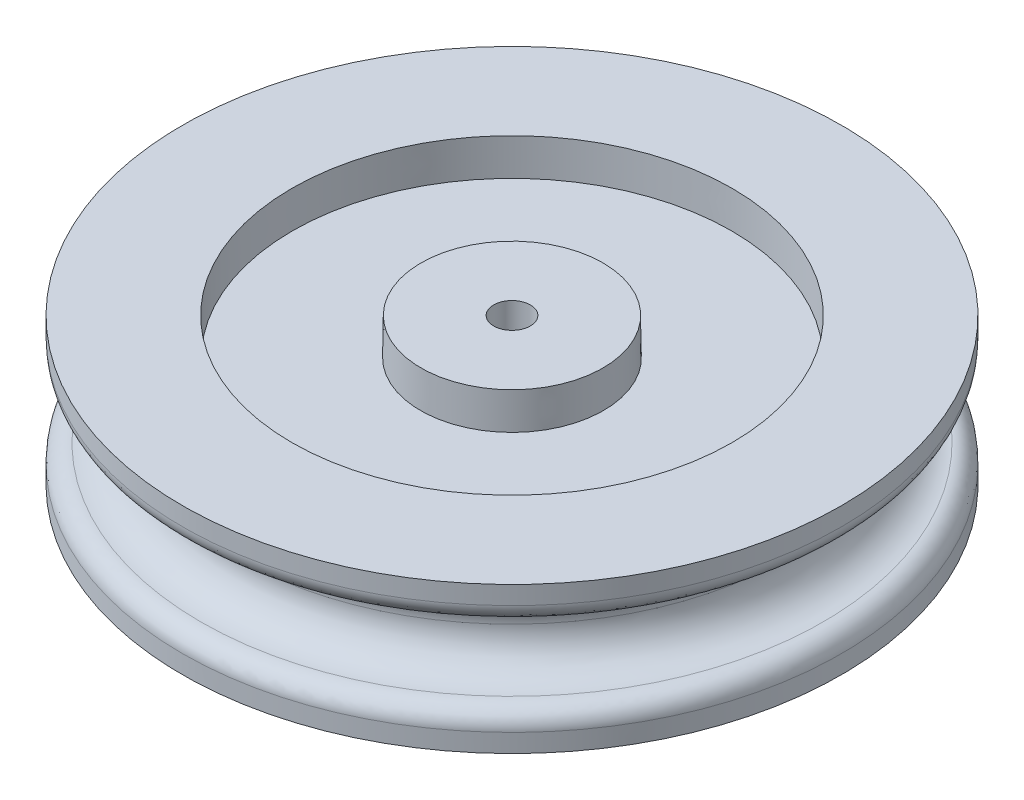
ISO-10303-21;
HEADER;
FILE_DESCRIPTION(('STEP AP214'),'2;1');
FILE_NAME('part.step','',(''),(''),'','','');
FILE_SCHEMA(('AUTOMOTIVE_DESIGN { 1 0 10303 214 1 1 1 1 }'));
ENDSEC;
DATA;
#1=APPLICATION_CONTEXT('core data for automotive mechanical design processes');
#2=APPLICATION_PROTOCOL_DEFINITION('international standard','automotive_design',2000,#1);
#3=PRODUCT_CONTEXT('',#1,'mechanical');
#4=PRODUCT('Part','Part','',(#3));
#5=PRODUCT_RELATED_PRODUCT_CATEGORY('part','',(#4));
#6=PRODUCT_DEFINITION_FORMATION('','',#4);
#7=PRODUCT_DEFINITION_CONTEXT('part definition',#1,'design');
#8=PRODUCT_DEFINITION('design','',#6,#7);
#9=PRODUCT_DEFINITION_SHAPE('','',#8);
#10=(LENGTH_UNIT() NAMED_UNIT(*) SI_UNIT(.MILLI.,.METRE.));
#11=(NAMED_UNIT(*) PLANE_ANGLE_UNIT() SI_UNIT($,.RADIAN.));
#12=(NAMED_UNIT(*) SI_UNIT($,.STERADIAN.) SOLID_ANGLE_UNIT());
#13=UNCERTAINTY_MEASURE_WITH_UNIT(LENGTH_MEASURE(1.E-05),#10,'distance_accuracy_value','');
#14=(GEOMETRIC_REPRESENTATION_CONTEXT(3) GLOBAL_UNCERTAINTY_ASSIGNED_CONTEXT((#13)) GLOBAL_UNIT_ASSIGNED_CONTEXT((#10,
#11,#12)) REPRESENTATION_CONTEXT('',''));
#15=CARTESIAN_POINT('',(0.,0.,0.));
#16=DIRECTION('',(0.,0.,1.));
#17=DIRECTION('',(1.,0.,0.));
#18=AXIS2_PLACEMENT_3D('',#15,#16,#17);
#19=CARTESIAN_POINT('',(0.,-1.2,0.));
#20=DIRECTION('',(0.,-1.,0.));
#21=DIRECTION('',(0.,0.,-1.));
#22=AXIS2_PLACEMENT_3D('',#19,#20,#21);
#23=CONICAL_SURFACE('',#22,1.,0.785398163397448);
#24=CARTESIAN_POINT('',(0.,-1.2,0.));
#25=DIRECTION('',(0.,-1.,0.));
#26=DIRECTION('',(0.,0.,-1.));
#27=AXIS2_PLACEMENT_3D('',#24,#25,#26);
#28=CIRCLE('',#27,1.);
#29=CARTESIAN_POINT('',(0.,-1.2,-1.));
#30=VERTEX_POINT('',#29);
#31=EDGE_CURVE('E41',#30,#30,#28,.T.);
#32=ORIENTED_EDGE('',*,*,#31,.F.);
#33=EDGE_LOOP('',(#32));
#34=FACE_BOUND('',#33,.T.);
#35=CARTESIAN_POINT('',(0.,-1.49999999999995,0.));
#36=DIRECTION('',(0.,-1.,0.));
#37=DIRECTION('',(0.,0.,-1.));
#38=AXIS2_PLACEMENT_3D('',#35,#36,#37);
#39=CIRCLE('',#38,1.29999999999995);
#40=CARTESIAN_POINT('',(0.,-1.49999999999995,-1.29999999999995));
#41=VERTEX_POINT('',#40);
#42=EDGE_CURVE('E17',#41,#41,#39,.F.);
#43=ORIENTED_EDGE('',*,*,#42,.F.);
#44=EDGE_LOOP('',(#43));
#45=FACE_BOUND('',#44,.T.);
#46=ADVANCED_FACE('F14',(#34,#45),#23,.F.);
#47=CARTESIAN_POINT('',(0.,2.7,0.));
#48=DIRECTION('',(0.,-1.,0.));
#49=DIRECTION('',(0.,0.,-1.));
#50=AXIS2_PLACEMENT_3D('',#47,#48,#49);
#51=CYLINDRICAL_SURFACE('',#50,1.);
#52=CARTESIAN_POINT('',(0.,2.7,0.));
#53=DIRECTION('',(0.,-1.,0.));
#54=DIRECTION('',(0.,0.,-1.));
#55=AXIS2_PLACEMENT_3D('',#52,#53,#54);
#56=CIRCLE('',#55,1.);
#57=CARTESIAN_POINT('',(0.,2.7,-1.));
#58=VERTEX_POINT('',#57);
#59=EDGE_CURVE('E76',#58,#58,#56,.T.);
#60=ORIENTED_EDGE('',*,*,#59,.F.);
#61=EDGE_LOOP('',(#60));
#62=FACE_BOUND('',#61,.T.);
#63=ORIENTED_EDGE('',*,*,#31,.T.);
#64=EDGE_LOOP('',(#63));
#65=FACE_BOUND('',#64,.T.);
#66=ADVANCED_FACE('F87',(#62,#65),#51,.F.);
#67=CARTESIAN_POINT('',(0.,-1.5,0.));
#68=DIRECTION('',(0.,-1.,0.));
#69=DIRECTION('',(0.,0.,-1.));
#70=AXIS2_PLACEMENT_3D('',#67,#68,#69);
#71=PLANE('',#70);
#72=ORIENTED_EDGE('',*,*,#42,.T.);
#73=EDGE_LOOP('',(#72));
#74=FACE_BOUND('',#73,.T.);
#75=CARTESIAN_POINT('',(0.,-1.49999999999995,0.));
#76=DIRECTION('',(0.,1.,0.));
#77=DIRECTION('',(0.,0.,1.));
#78=AXIS2_PLACEMENT_3D('',#75,#76,#77);
#79=CIRCLE('',#78,2.465091146);
#80=CARTESIAN_POINT('',(0.,-1.49999999999995,2.465091146));
#81=VERTEX_POINT('',#80);
#82=EDGE_CURVE('E74',#81,#81,#79,.T.);
#83=ORIENTED_EDGE('',*,*,#82,.F.);
#84=EDGE_LOOP('',(#83));
#85=FACE_BOUND('',#84,.T.);
#86=ADVANCED_FACE('F83',(#74,#85),#71,.T.);
#87=CARTESIAN_POINT('',(0.,2.7,0.));
#88=DIRECTION('',(0.,1.,0.));
#89=DIRECTION('',(0.,0.,1.));
#90=AXIS2_PLACEMENT_3D('',#87,#88,#89);
#91=PLANE('',#90);
#92=CARTESIAN_POINT('',(0.,2.7,0.));
#93=DIRECTION('',(0.,1.,0.));
#94=DIRECTION('',(0.,0.,1.));
#95=AXIS2_PLACEMENT_3D('',#92,#93,#94);
#96=CIRCLE('',#95,0.5);
#97=CARTESIAN_POINT('',(0.,2.7,0.5));
#98=VERTEX_POINT('',#97);
#99=EDGE_CURVE('E71',#98,#98,#96,.F.);
#100=ORIENTED_EDGE('',*,*,#99,.F.);
#101=EDGE_LOOP('',(#100));
#102=FACE_BOUND('',#101,.T.);
#103=ORIENTED_EDGE('',*,*,#59,.T.);
#104=EDGE_LOOP('',(#103));
#105=FACE_BOUND('',#104,.T.);
#106=ADVANCED_FACE('F183',(#102,#105),#91,.F.);
#107=CARTESIAN_POINT('',(0.,1.,0.));
#108=DIRECTION('',(0.,1.,0.));
#109=DIRECTION('',(0.,0.,1.));
#110=AXIS2_PLACEMENT_3D('',#107,#108,#109);
#111=CONICAL_SURFACE('',#110,2.5,0.0139626341667435);
#112=CARTESIAN_POINT('',(0.,1.,0.));
#113=DIRECTION('',(0.,1.,0.));
#114=DIRECTION('',(0.,0.,1.));
#115=AXIS2_PLACEMENT_3D('',#112,#113,#114);
#116=CIRCLE('',#115,2.5);
#117=CARTESIAN_POINT('',(0.,1.,2.5));
#118=VERTEX_POINT('',#117);
#119=EDGE_CURVE('E68',#118,#118,#116,.T.);
#120=ORIENTED_EDGE('',*,*,#119,.F.);
#121=EDGE_LOOP('',(#120));
#122=FACE_BOUND('',#121,.T.);
#123=ORIENTED_EDGE('',*,*,#82,.T.);
#124=EDGE_LOOP('',(#123));
#125=FACE_BOUND('',#124,.T.);
#126=ADVANCED_FACE('F179',(#122,#125),#111,.T.);
#127=CARTESIAN_POINT('',(0.,2.7,0.));
#128=DIRECTION('',(0.,1.,0.));
#129=DIRECTION('',(0.,0.,1.));
#130=AXIS2_PLACEMENT_3D('',#127,#128,#129);
#131=CYLINDRICAL_SURFACE('',#130,0.5);
#132=CARTESIAN_POINT('',(0.,4.,0.));
#133=DIRECTION('',(0.,1.,0.));
#134=DIRECTION('',(0.,0.,1.));
#135=AXIS2_PLACEMENT_3D('',#132,#133,#134);
#136=CIRCLE('',#135,0.5);
#137=CARTESIAN_POINT('',(0.,4.,0.5));
#138=VERTEX_POINT('',#137);
#139=EDGE_CURVE('E65',#138,#138,#136,.F.);
#140=ORIENTED_EDGE('',*,*,#139,.F.);
#141=EDGE_LOOP('',(#140));
#142=FACE_BOUND('',#141,.T.);
#143=ORIENTED_EDGE('',*,*,#99,.T.);
#144=EDGE_LOOP('',(#143));
#145=FACE_BOUND('',#144,.T.);
#146=ADVANCED_FACE('F175',(#142,#145),#131,.F.);
#147=CARTESIAN_POINT('',(0.,1.,-2.5));
#148=DIRECTION('',(0.,-1.,0.));
#149=DIRECTION('',(0.,0.,-1.));
#150=AXIS2_PLACEMENT_3D('',#147,#148,#149);
#151=PLANE('',#150);
#152=ORIENTED_EDGE('',*,*,#119,.T.);
#153=EDGE_LOOP('',(#152));
#154=FACE_BOUND('',#153,.T.);
#155=CARTESIAN_POINT('',(0.,0.99999999999989,0.));
#156=DIRECTION('',(0.,-1.,0.));
#157=DIRECTION('',(0.,0.,-1.));
#158=AXIS2_PLACEMENT_3D('',#155,#156,#157);
#159=CIRCLE('',#158,6.);
#160=CARTESIAN_POINT('',(0.,0.99999999999989,-6.));
#161=VERTEX_POINT('',#160);
#162=EDGE_CURVE('E62',#161,#161,#159,.F.);
#163=ORIENTED_EDGE('',*,*,#162,.F.);
#164=EDGE_LOOP('',(#163));
#165=FACE_BOUND('',#164,.T.);
#166=ADVANCED_FACE('F171',(#154,#165),#151,.T.);
#167=CARTESIAN_POINT('',(0.,4.,-2.5));
#168=DIRECTION('',(0.,1.,0.));
#169=DIRECTION('',(0.,0.,1.));
#170=AXIS2_PLACEMENT_3D('',#167,#168,#169);
#171=PLANE('',#170);
#172=ORIENTED_EDGE('',*,*,#139,.T.);
#173=EDGE_LOOP('',(#172));
#174=FACE_BOUND('',#173,.T.);
#175=CARTESIAN_POINT('',(0.,4.,0.));
#176=DIRECTION('',(0.,-1.,0.));
#177=DIRECTION('',(0.,0.,-1.));
#178=AXIS2_PLACEMENT_3D('',#175,#176,#177);
#179=CIRCLE('',#178,2.486036459);
#180=CARTESIAN_POINT('',(0.,4.,-2.486036459));
#181=VERTEX_POINT('',#180);
#182=EDGE_CURVE('E59',#181,#181,#179,.T.);
#183=ORIENTED_EDGE('',*,*,#182,.F.);
#184=EDGE_LOOP('',(#183));
#185=FACE_BOUND('',#184,.T.);
#186=ADVANCED_FACE('F167',(#174,#185),#171,.T.);
#187=CARTESIAN_POINT('',(0.,1.,0.));
#188=DIRECTION('',(0.,-1.,0.));
#189=DIRECTION('',(0.,0.,-1.));
#190=AXIS2_PLACEMENT_3D('',#187,#188,#189);
#191=CONICAL_SURFACE('',#190,6.,0.0139626335668602);
#192=CARTESIAN_POINT('',(0.,0.,0.));
#193=DIRECTION('',(0.,-1.,0.));
#194=DIRECTION('',(0.,0.,-1.));
#195=AXIS2_PLACEMENT_3D('',#192,#193,#194);
#196=CIRCLE('',#195,6.013963541);
#197=CARTESIAN_POINT('',(0.,0.,-6.013963541));
#198=VERTEX_POINT('',#197);
#199=EDGE_CURVE('E56',#198,#198,#196,.F.);
#200=ORIENTED_EDGE('',*,*,#199,.F.);
#201=EDGE_LOOP('',(#200));
#202=FACE_BOUND('',#201,.T.);
#203=ORIENTED_EDGE('',*,*,#162,.T.);
#204=EDGE_LOOP('',(#203));
#205=FACE_BOUND('',#204,.T.);
#206=ADVANCED_FACE('F163',(#202,#205),#191,.F.);
#207=CARTESIAN_POINT('',(0.,3.,0.));
#208=DIRECTION('',(0.,-1.,0.));
#209=DIRECTION('',(0.,0.,-1.));
#210=AXIS2_PLACEMENT_3D('',#207,#208,#209);
#211=CONICAL_SURFACE('',#210,2.5,0.0139626335668606);
#212=ORIENTED_EDGE('',*,*,#182,.T.);
#213=EDGE_LOOP('',(#212));
#214=FACE_BOUND('',#213,.T.);
#215=CARTESIAN_POINT('',(0.,2.99999999999989,0.));
#216=DIRECTION('',(0.,-1.,0.));
#217=DIRECTION('',(0.,0.,-1.));
#218=AXIS2_PLACEMENT_3D('',#215,#216,#217);
#219=CIRCLE('',#218,2.5);
#220=CARTESIAN_POINT('',(0.,2.99999999999989,-2.5));
#221=VERTEX_POINT('',#220);
#222=EDGE_CURVE('E53',#221,#221,#219,.T.);
#223=ORIENTED_EDGE('',*,*,#222,.F.);
#224=EDGE_LOOP('',(#223));
#225=FACE_BOUND('',#224,.T.);
#226=ADVANCED_FACE('F159',(#214,#225),#211,.T.);
#227=CARTESIAN_POINT('',(0.,0.,-6.));
#228=DIRECTION('',(0.,-1.,0.));
#229=DIRECTION('',(0.,0.,-1.));
#230=AXIS2_PLACEMENT_3D('',#227,#228,#229);
#231=PLANE('',#230);
#232=ORIENTED_EDGE('',*,*,#199,.T.);
#233=EDGE_LOOP('',(#232));
#234=FACE_BOUND('',#233,.T.);
#235=CARTESIAN_POINT('',(0.,0.,0.));
#236=DIRECTION('',(0.,-1.,0.));
#237=DIRECTION('',(0.,0.,-1.));
#238=AXIS2_PLACEMENT_3D('',#235,#236,#237);
#239=CIRCLE('',#238,9.);
#240=CARTESIAN_POINT('',(0.,0.,-9.));
#241=VERTEX_POINT('',#240);
#242=EDGE_CURVE('E50',#241,#241,#239,.F.);
#243=ORIENTED_EDGE('',*,*,#242,.F.);
#244=EDGE_LOOP('',(#243));
#245=FACE_BOUND('',#244,.T.);
#246=ADVANCED_FACE('F155',(#234,#245),#231,.T.);
#247=CARTESIAN_POINT('',(0.,3.,-6.));
#248=DIRECTION('',(0.,1.,0.));
#249=DIRECTION('',(0.,0.,1.));
#250=AXIS2_PLACEMENT_3D('',#247,#248,#249);
#251=PLANE('',#250);
#252=ORIENTED_EDGE('',*,*,#222,.T.);
#253=EDGE_LOOP('',(#252));
#254=FACE_BOUND('',#253,.T.);
#255=CARTESIAN_POINT('',(0.,3.,0.));
#256=DIRECTION('',(0.,1.,0.));
#257=DIRECTION('',(0.,0.,1.));
#258=AXIS2_PLACEMENT_3D('',#255,#256,#257);
#259=CIRCLE('',#258,6.);
#260=CARTESIAN_POINT('',(0.,3.,6.));
#261=VERTEX_POINT('',#260);
#262=EDGE_CURVE('E37',#261,#261,#259,.F.);
#263=ORIENTED_EDGE('',*,*,#262,.F.);
#264=EDGE_LOOP('',(#263));
#265=FACE_BOUND('',#264,.T.);
#266=ADVANCED_FACE('F151',(#254,#265),#251,.T.);
#267=CARTESIAN_POINT('',(0.,0.,0.));
#268=DIRECTION('',(0.,-1.,0.));
#269=DIRECTION('',(0.,0.,-1.));
#270=AXIS2_PLACEMENT_3D('',#267,#268,#269);
#271=CYLINDRICAL_SURFACE('',#270,9.);
#272=CARTESIAN_POINT('',(0.,0.500000000000002,0.));
#273=DIRECTION('',(0.,1.,0.));
#274=DIRECTION('',(0.,0.,1.));
#275=AXIS2_PLACEMENT_3D('',#272,#273,#274);
#276=CIRCLE('',#275,9.);
#277=CARTESIAN_POINT('',(0.,0.500000000000002,9.));
#278=VERTEX_POINT('',#277);
#279=EDGE_CURVE('E33',#278,#278,#276,.T.);
#280=ORIENTED_EDGE('',*,*,#279,.F.);
#281=EDGE_LOOP('',(#280));
#282=FACE_BOUND('',#281,.T.);
#283=ORIENTED_EDGE('',*,*,#242,.T.);
#284=EDGE_LOOP('',(#283));
#285=FACE_BOUND('',#284,.T.);
#286=ADVANCED_FACE('F147',(#282,#285),#271,.T.);
#287=CARTESIAN_POINT('',(0.,3.,0.));
#288=DIRECTION('',(0.,1.,0.));
#289=DIRECTION('',(0.,0.,1.));
#290=AXIS2_PLACEMENT_3D('',#287,#288,#289);
#291=CONICAL_SURFACE('',#290,6.,0.0139626335668602);
#292=ORIENTED_EDGE('',*,*,#262,.T.);
#293=EDGE_LOOP('',(#292));
#294=FACE_BOUND('',#293,.T.);
#295=CARTESIAN_POINT('',(0.,3.99999999999989,0.));
#296=DIRECTION('',(0.,1.,0.));
#297=DIRECTION('',(0.,0.,1.));
#298=AXIS2_PLACEMENT_3D('',#295,#296,#297);
#299=CIRCLE('',#298,6.013963541);
#300=CARTESIAN_POINT('',(0.,3.99999999999989,6.013963541));
#301=VERTEX_POINT('',#300);
#302=EDGE_CURVE('E36',#301,#301,#299,.F.);
#303=ORIENTED_EDGE('',*,*,#302,.F.);
#304=EDGE_LOOP('',(#303));
#305=FACE_BOUND('',#304,.T.);
#306=ADVANCED_FACE('F143',(#294,#305),#291,.F.);
#307=CARTESIAN_POINT('',(0.,1.,8.5));
#308=CARTESIAN_POINT('',(0.,1.,8.79289321881345));
#309=CARTESIAN_POINT('',(0.,0.792893218813454,9.));
#310=CARTESIAN_POINT('',(0.,0.500000000000002,9.));
#311=(BOUNDED_CURVE() B_SPLINE_CURVE(3,(#307,#308,#309,#310),.UNSPECIFIED.,.F.,
.F.) B_SPLINE_CURVE_WITH_KNOTS((4,4),(0.,1.),
.UNSPECIFIED.) CURVE() GEOMETRIC_REPRESENTATION_ITEM() RATIONAL_B_SPLINE_CURVE((1.,
0.804737854124365,0.804737854124365,1.)) REPRESENTATION_ITEM(''));
#312=CARTESIAN_POINT('',(0.,0.5,0.));
#313=DIRECTION('',(0.,1.,0.));
#314=AXIS1_PLACEMENT('',#312,#313);
#315=SURFACE_OF_REVOLUTION('',#311,#314);
#316=ORIENTED_EDGE('',*,*,#279,.T.);
#317=EDGE_LOOP('',(#316));
#318=FACE_BOUND('',#317,.T.);
#319=CARTESIAN_POINT('',(0.,0.999999999999999,0.));
#320=DIRECTION('',(0.,1.,0.));
#321=DIRECTION('',(0.,0.,1.));
#322=AXIS2_PLACEMENT_3D('',#319,#320,#321);
#323=CIRCLE('',#322,8.5);
#324=CARTESIAN_POINT('',(0.,0.999999999999999,8.5));
#325=VERTEX_POINT('',#324);
#326=EDGE_CURVE('E38',#325,#325,#323,.T.);
#327=ORIENTED_EDGE('',*,*,#326,.F.);
#328=EDGE_LOOP('',(#327));
#329=FACE_BOUND('',#328,.T.);
#330=ADVANCED_FACE('F139',(#318,#329),#315,.F.);
#331=CARTESIAN_POINT('',(0.,4.,-9.));
#332=DIRECTION('',(0.,1.,0.));
#333=DIRECTION('',(0.,0.,1.));
#334=AXIS2_PLACEMENT_3D('',#331,#332,#333);
#335=PLANE('',#334);
#336=ORIENTED_EDGE('',*,*,#302,.T.);
#337=EDGE_LOOP('',(#336));
#338=FACE_BOUND('',#337,.T.);
#339=CARTESIAN_POINT('',(0.,4.,0.));
#340=DIRECTION('',(0.,-1.,0.));
#341=DIRECTION('',(1.,0.,0.));
#342=AXIS2_PLACEMENT_3D('',#339,#340,#341);
#343=CIRCLE('',#342,9.);
#344=CARTESIAN_POINT('',(9.,4.,0.));
#345=VERTEX_POINT('',#344);
#346=EDGE_CURVE('E32',#345,#345,#343,.T.);
#347=ORIENTED_EDGE('',*,*,#346,.F.);
#348=EDGE_LOOP('',(#347));
#349=FACE_BOUND('',#348,.T.);
#350=ADVANCED_FACE('F135',(#338,#349),#335,.T.);
#351=CARTESIAN_POINT('',(0.,1.99999999999999,7.5));
#352=CARTESIAN_POINT('',(0.,1.41421356237309,7.5));
#353=CARTESIAN_POINT('',(0.,0.999999999999995,7.9142135623731));
#354=CARTESIAN_POINT('',(0.,0.999999999999999,8.5));
#355=(BOUNDED_CURVE() B_SPLINE_CURVE(3,(#351,#352,#353,#354),.UNSPECIFIED.,.F.,
.F.) B_SPLINE_CURVE_WITH_KNOTS((4,4),(0.,1.),
.UNSPECIFIED.) CURVE() GEOMETRIC_REPRESENTATION_ITEM() RATIONAL_B_SPLINE_CURVE((1.,
0.804737854124365,0.804737854124365,1.)) REPRESENTATION_ITEM(''));
#356=CARTESIAN_POINT('',(0.,2.,0.));
#357=DIRECTION('',(0.,1.,0.));
#358=AXIS1_PLACEMENT('',#356,#357);
#359=SURFACE_OF_REVOLUTION('',#355,#358);
#360=ORIENTED_EDGE('',*,*,#326,.T.);
#361=EDGE_LOOP('',(#360));
#362=FACE_BOUND('',#361,.T.);
#363=CARTESIAN_POINT('',(0.,2.,0.));
#364=DIRECTION('',(0.,-1.,0.));
#365=DIRECTION('',(0.,0.,-1.));
#366=AXIS2_PLACEMENT_3D('',#363,#364,#365);
#367=CIRCLE('',#366,7.5);
#368=CARTESIAN_POINT('',(0.,2.,-7.5));
#369=VERTEX_POINT('',#368);
#370=EDGE_CURVE('E26',#369,#369,#367,.F.);
#371=ORIENTED_EDGE('',*,*,#370,.F.);
#372=EDGE_LOOP('',(#371));
#373=FACE_BOUND('',#372,.T.);
#374=ADVANCED_FACE('F132',(#362,#373),#359,.F.);
#375=CARTESIAN_POINT('',(0.,3.5,0.));
#376=DIRECTION('',(0.,-1.,0.));
#377=DIRECTION('',(1.,0.,0.));
#378=AXIS2_PLACEMENT_3D('',#375,#376,#377);
#379=CYLINDRICAL_SURFACE('',#378,9.);
#380=ORIENTED_EDGE('',*,*,#346,.T.);
#381=EDGE_LOOP('',(#380));
#382=FACE_BOUND('',#381,.T.);
#383=CARTESIAN_POINT('',(0.,3.5,0.));
#384=DIRECTION('',(0.,-1.,0.));
#385=DIRECTION('',(0.,0.,-1.));
#386=AXIS2_PLACEMENT_3D('',#383,#384,#385);
#387=CIRCLE('',#386,9.);
#388=CARTESIAN_POINT('',(0.,3.5,-9.));
#389=VERTEX_POINT('',#388);
#390=EDGE_CURVE('E21',#389,#389,#387,.T.);
#391=ORIENTED_EDGE('',*,*,#390,.F.);
#392=EDGE_LOOP('',(#391));
#393=FACE_BOUND('',#392,.T.);
#394=ADVANCED_FACE('F103',(#382,#393),#379,.T.);
#395=CARTESIAN_POINT('',(0.,2.,-7.5));
#396=CARTESIAN_POINT('',(0.,2.5857864376269,-7.5));
#397=CARTESIAN_POINT('',(0.,3.,-7.9142135623731));
#398=CARTESIAN_POINT('',(0.,3.,-8.5));
#399=(BOUNDED_CURVE() B_SPLINE_CURVE(3,(#395,#396,#397,#398),.UNSPECIFIED.,.F.,
.F.) B_SPLINE_CURVE_WITH_KNOTS((4,4),(0.,1.),
.UNSPECIFIED.) CURVE() GEOMETRIC_REPRESENTATION_ITEM() RATIONAL_B_SPLINE_CURVE((1.,
0.804737854124365,0.804737854124365,1.)) REPRESENTATION_ITEM(''));
#400=CARTESIAN_POINT('',(0.,2.,0.));
#401=DIRECTION('',(0.,-1.,0.));
#402=AXIS1_PLACEMENT('',#400,#401);
#403=SURFACE_OF_REVOLUTION('',#399,#402);
#404=CARTESIAN_POINT('',(0.,3.,0.));
#405=DIRECTION('',(0.,-1.,0.));
#406=DIRECTION('',(0.,0.,-1.));
#407=AXIS2_PLACEMENT_3D('',#404,#405,#406);
#408=CIRCLE('',#407,8.50000000000001);
#409=CARTESIAN_POINT('',(0.,3.,-8.50000000000001));
#410=VERTEX_POINT('',#409);
#411=EDGE_CURVE('E10',#410,#410,#408,.F.);
#412=ORIENTED_EDGE('',*,*,#411,.F.);
#413=EDGE_LOOP('',(#412));
#414=FACE_BOUND('',#413,.T.);
#415=ORIENTED_EDGE('',*,*,#370,.T.);
#416=EDGE_LOOP('',(#415));
#417=FACE_BOUND('',#416,.T.);
#418=ADVANCED_FACE('F97',(#414,#417),#403,.F.);
#419=CARTESIAN_POINT('',(0.,3.,-8.50000000000001));
#420=CARTESIAN_POINT('',(0.,3.,-8.79289321881346));
#421=CARTESIAN_POINT('',(0.,3.20710678118655,-9.));
#422=CARTESIAN_POINT('',(0.,3.5,-9.));
#423=(BOUNDED_CURVE() B_SPLINE_CURVE(3,(#419,#420,#421,#422),.UNSPECIFIED.,.F.,
.F.) B_SPLINE_CURVE_WITH_KNOTS((4,4),(0.,1.),
.UNSPECIFIED.) CURVE() GEOMETRIC_REPRESENTATION_ITEM() RATIONAL_B_SPLINE_CURVE((1.,
0.804737854124367,0.804737854124367,1.)) REPRESENTATION_ITEM(''));
#424=CARTESIAN_POINT('',(0.,3.5,0.));
#425=DIRECTION('',(0.,-1.,0.));
#426=AXIS1_PLACEMENT('',#424,#425);
#427=SURFACE_OF_REVOLUTION('',#423,#426);
#428=ORIENTED_EDGE('',*,*,#390,.T.);
#429=EDGE_LOOP('',(#428));
#430=FACE_BOUND('',#429,.T.);
#431=ORIENTED_EDGE('',*,*,#411,.T.);
#432=EDGE_LOOP('',(#431));
#433=FACE_BOUND('',#432,.T.);
#434=ADVANCED_FACE('F95',(#430,#433),#427,.F.);
#435=CLOSED_SHELL('',(#46,#66,#86,#106,#126,#146,#166,#186,#206,#226,#246,#266,#286,#306,#330,
#350,#374,#394,#418,#434));
#436=MANIFOLD_SOLID_BREP('B1',#435);
#437=ADVANCED_BREP_SHAPE_REPRESENTATION('',(#18,#436),#14);
#438=SHAPE_DEFINITION_REPRESENTATION(#9,#437);
ENDSEC;
END-ISO-10303-21;
